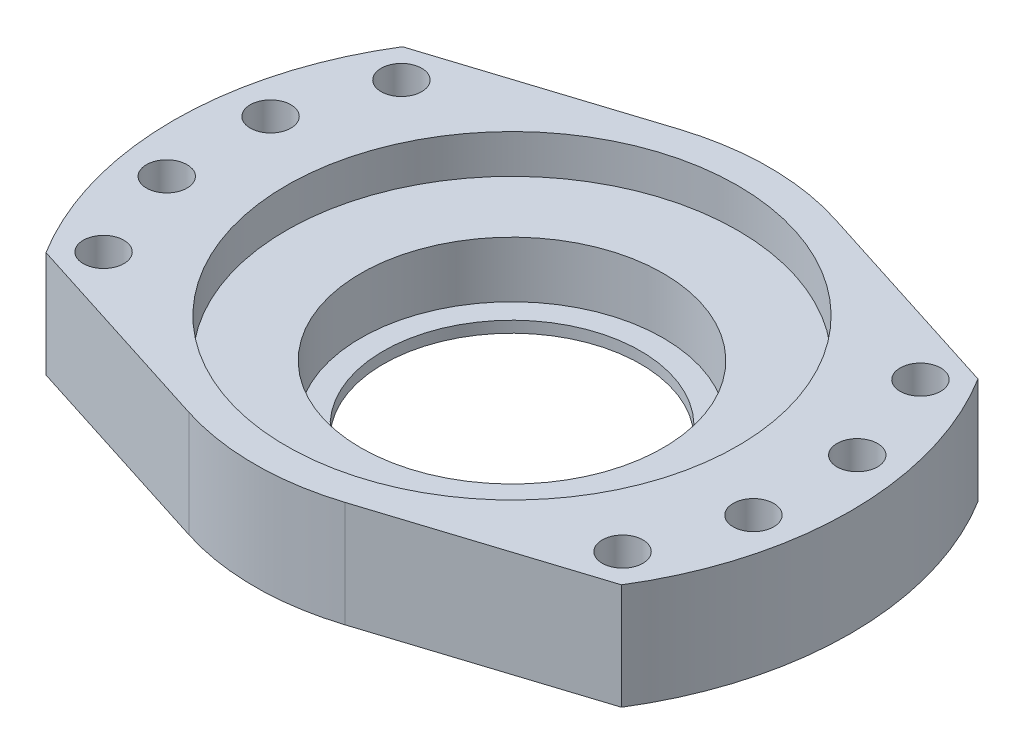
ISO-10303-21;
HEADER;
FILE_DESCRIPTION(('STEP AP214'),'2;1');
FILE_NAME('part.step','',(''),(''),'','','');
FILE_SCHEMA(('AUTOMOTIVE_DESIGN { 1 0 10303 214 1 1 1 1 }'));
ENDSEC;
DATA;
#1=APPLICATION_CONTEXT('core data for automotive mechanical design processes');
#2=APPLICATION_PROTOCOL_DEFINITION('international standard','automotive_design',2000,#1);
#3=PRODUCT_CONTEXT('',#1,'mechanical');
#4=PRODUCT('Part','Part','',(#3));
#5=PRODUCT_RELATED_PRODUCT_CATEGORY('part','',(#4));
#6=PRODUCT_DEFINITION_FORMATION('','',#4);
#7=PRODUCT_DEFINITION_CONTEXT('part definition',#1,'design');
#8=PRODUCT_DEFINITION('design','',#6,#7);
#9=PRODUCT_DEFINITION_SHAPE('','',#8);
#10=(LENGTH_UNIT() NAMED_UNIT(*) SI_UNIT(.MILLI.,.METRE.));
#11=(NAMED_UNIT(*) PLANE_ANGLE_UNIT() SI_UNIT($,.RADIAN.));
#12=(NAMED_UNIT(*) SI_UNIT($,.STERADIAN.) SOLID_ANGLE_UNIT());
#13=UNCERTAINTY_MEASURE_WITH_UNIT(LENGTH_MEASURE(1.E-05),#10,'distance_accuracy_value','');
#14=(GEOMETRIC_REPRESENTATION_CONTEXT(3) GLOBAL_UNCERTAINTY_ASSIGNED_CONTEXT((#13)) GLOBAL_UNIT_ASSIGNED_CONTEXT((#10,
#11,#12)) REPRESENTATION_CONTEXT('',''));
#15=CARTESIAN_POINT('',(0.,0.,0.));
#16=DIRECTION('',(0.,0.,1.));
#17=DIRECTION('',(1.,0.,0.));
#18=AXIS2_PLACEMENT_3D('',#15,#16,#17);
#19=CARTESIAN_POINT('',(0.,4.80000000000003,0.));
#20=DIRECTION('',(0.,-1.,0.));
#21=DIRECTION('',(0.,0.,-1.));
#22=AXIS2_PLACEMENT_3D('',#19,#20,#21);
#23=PLANE('',#22);
#24=CARTESIAN_POINT('',(0.,4.80000000000003,0.));
#25=DIRECTION('',(0.,-1.,0.));
#26=DIRECTION('',(0.,0.,-1.));
#27=AXIS2_PLACEMENT_3D('',#24,#25,#26);
#28=CIRCLE('',#27,67.);
#29=CARTESIAN_POINT('',(0.,4.80000000000003,-67.0000000000003));
#30=VERTEX_POINT('',#29);
#31=EDGE_CURVE('E194',#30,#30,#28,.T.);
#32=ORIENTED_EDGE('',*,*,#31,.T.);
#33=EDGE_LOOP('',(#32));
#34=FACE_BOUND('',#33,.T.);
#35=CARTESIAN_POINT('',(0.,4.80000000000003,0.));
#36=DIRECTION('',(0.,-1.,0.));
#37=DIRECTION('',(0.,0.,-1.));
#38=AXIS2_PLACEMENT_3D('',#35,#36,#37);
#39=CIRCLE('',#38,100.);
#40=CARTESIAN_POINT('',(0.,4.80000000000003,-100.));
#41=VERTEX_POINT('',#40);
#42=EDGE_CURVE('E19',#41,#41,#39,.F.);
#43=ORIENTED_EDGE('',*,*,#42,.T.);
#44=EDGE_LOOP('',(#43));
#45=FACE_BOUND('',#44,.T.);
#46=ADVANCED_FACE('F16',(#34,#45),#23,.F.);
#47=CARTESIAN_POINT('',(0.,22.,0.));
#48=DIRECTION('',(0.,-1.,0.));
#49=DIRECTION('',(0.,0.,-1.));
#50=AXIS2_PLACEMENT_3D('',#47,#48,#49);
#51=CYLINDRICAL_SURFACE('',#50,100.);
#52=CARTESIAN_POINT('',(0.,22.,0.));
#53=DIRECTION('',(0.,-1.,0.));
#54=DIRECTION('',(0.,0.,-1.));
#55=AXIS2_PLACEMENT_3D('',#52,#53,#54);
#56=CIRCLE('',#55,100.);
#57=CARTESIAN_POINT('',(0.,22.,-100.));
#58=VERTEX_POINT('',#57);
#59=EDGE_CURVE('E192',#58,#58,#56,.T.);
#60=ORIENTED_EDGE('',*,*,#59,.F.);
#61=EDGE_LOOP('',(#60));
#62=FACE_BOUND('',#61,.T.);
#63=ORIENTED_EDGE('',*,*,#42,.F.);
#64=EDGE_LOOP('',(#63));
#65=FACE_BOUND('',#64,.T.);
#66=ADVANCED_FACE('F202',(#62,#65),#51,.F.);
#67=CARTESIAN_POINT('',(0.,4.80000000000003,0.));
#68=DIRECTION('',(0.,-1.,0.));
#69=DIRECTION('',(0.,0.,-1.));
#70=AXIS2_PLACEMENT_3D('',#67,#68,#69);
#71=CYLINDRICAL_SURFACE('',#70,67.);
#72=CARTESIAN_POINT('',(0.,-20.0000000000005,0.));
#73=DIRECTION('',(0.,-1.,0.));
#74=DIRECTION('',(0.,0.,-1.));
#75=AXIS2_PLACEMENT_3D('',#72,#73,#74);
#76=CIRCLE('',#75,67.);
#77=CARTESIAN_POINT('',(0.,-20.0000000000005,-67.0000000000003));
#78=VERTEX_POINT('',#77);
#79=EDGE_CURVE('E90',#78,#78,#76,.T.);
#80=ORIENTED_EDGE('',*,*,#79,.T.);
#81=EDGE_LOOP('',(#80));
#82=FACE_BOUND('',#81,.T.);
#83=ORIENTED_EDGE('',*,*,#31,.F.);
#84=EDGE_LOOP('',(#83));
#85=FACE_BOUND('',#84,.T.);
#86=ADVANCED_FACE('F204',(#82,#85),#71,.F.);
#87=CARTESIAN_POINT('',(0.,22.,0.));
#88=DIRECTION('',(0.,1.,0.));
#89=DIRECTION('',(0.,0.,1.));
#90=AXIS2_PLACEMENT_3D('',#87,#88,#89);
#91=PLANE('',#90);
#92=CARTESIAN_POINT('',(-115.,22.,-66.));
#93=DIRECTION('',(0.,1.,0.));
#94=DIRECTION('',(0.,0.,1.));
#95=AXIS2_PLACEMENT_3D('',#92,#93,#94);
#96=CIRCLE('',#95,9.);
#97=CARTESIAN_POINT('',(-115.,22.,-56.9999999999999));
#98=VERTEX_POINT('',#97);
#99=EDGE_CURVE('E159',#98,#98,#96,.F.);
#100=ORIENTED_EDGE('',*,*,#99,.T.);
#101=EDGE_LOOP('',(#100));
#102=FACE_BOUND('',#101,.T.);
#103=CARTESIAN_POINT('',(-130.000000000001,22.,-22.9999999999999));
#104=DIRECTION('',(0.,1.,0.));
#105=DIRECTION('',(0.,0.,1.));
#106=AXIS2_PLACEMENT_3D('',#103,#104,#105);
#107=CIRCLE('',#106,9.);
#108=CARTESIAN_POINT('',(-130.000000000001,22.,-13.9999999999998));
#109=VERTEX_POINT('',#108);
#110=EDGE_CURVE('E162',#109,#109,#107,.F.);
#111=ORIENTED_EDGE('',*,*,#110,.T.);
#112=EDGE_LOOP('',(#111));
#113=FACE_BOUND('',#112,.T.);
#114=CARTESIAN_POINT('',(115.,22.,-66.0000000000001));
#115=DIRECTION('',(0.,1.,0.));
#116=DIRECTION('',(0.,0.,1.));
#117=AXIS2_PLACEMENT_3D('',#114,#115,#116);
#118=CIRCLE('',#117,9.);
#119=CARTESIAN_POINT('',(115.,22.,-57.));
#120=VERTEX_POINT('',#119);
#121=EDGE_CURVE('E165',#120,#120,#118,.F.);
#122=ORIENTED_EDGE('',*,*,#121,.T.);
#123=EDGE_LOOP('',(#122));
#124=FACE_BOUND('',#123,.T.);
#125=CARTESIAN_POINT('',(130.,22.,-23.));
#126=DIRECTION('',(0.,1.,0.));
#127=DIRECTION('',(0.,0.,1.));
#128=AXIS2_PLACEMENT_3D('',#125,#126,#127);
#129=CIRCLE('',#128,9.);
#130=CARTESIAN_POINT('',(130.,22.,-14.));
#131=VERTEX_POINT('',#130);
#132=EDGE_CURVE('E168',#131,#131,#129,.F.);
#133=ORIENTED_EDGE('',*,*,#132,.T.);
#134=EDGE_LOOP('',(#133));
#135=FACE_BOUND('',#134,.T.);
#136=CARTESIAN_POINT('',(-115.,21.999999999999,66.0000000000011));
#137=DIRECTION('',(0.,1.,0.));
#138=DIRECTION('',(0.,0.,1.));
#139=AXIS2_PLACEMENT_3D('',#136,#137,#138);
#140=CIRCLE('',#139,9.);
#141=CARTESIAN_POINT('',(-115.,21.999999999999,75.0000000000011));
#142=VERTEX_POINT('',#141);
#143=EDGE_CURVE('E171',#142,#142,#140,.F.);
#144=ORIENTED_EDGE('',*,*,#143,.T.);
#145=EDGE_LOOP('',(#144));
#146=FACE_BOUND('',#145,.T.);
#147=CARTESIAN_POINT('',(-130.000000000001,22.,23.0000000000006));
#148=DIRECTION('',(0.,1.,0.));
#149=DIRECTION('',(0.,0.,1.));
#150=AXIS2_PLACEMENT_3D('',#147,#148,#149);
#151=CIRCLE('',#150,9.);
#152=CARTESIAN_POINT('',(-130.000000000001,22.,32.0000000000007));
#153=VERTEX_POINT('',#152);
#154=EDGE_CURVE('E174',#153,#153,#151,.F.);
#155=ORIENTED_EDGE('',*,*,#154,.T.);
#156=EDGE_LOOP('',(#155));
#157=FACE_BOUND('',#156,.T.);
#158=CARTESIAN_POINT('',(115.,21.999999999999,66.0000000000006));
#159=DIRECTION('',(0.,1.,0.));
#160=DIRECTION('',(0.,0.,1.));
#161=AXIS2_PLACEMENT_3D('',#158,#159,#160);
#162=CIRCLE('',#161,9.);
#163=CARTESIAN_POINT('',(115.,21.999999999999,75.0000000000007));
#164=VERTEX_POINT('',#163);
#165=EDGE_CURVE('E177',#164,#164,#162,.F.);
#166=ORIENTED_EDGE('',*,*,#165,.T.);
#167=EDGE_LOOP('',(#166));
#168=FACE_BOUND('',#167,.T.);
#169=CARTESIAN_POINT('',(130.,22.,23.0000000000005));
#170=DIRECTION('',(0.,1.,0.));
#171=DIRECTION('',(0.,0.,1.));
#172=AXIS2_PLACEMENT_3D('',#169,#170,#171);
#173=CIRCLE('',#172,9.);
#174=CARTESIAN_POINT('',(130.,22.,32.0000000000005));
#175=VERTEX_POINT('',#174);
#176=EDGE_CURVE('E107',#175,#175,#173,.F.);
#177=ORIENTED_EDGE('',*,*,#176,.T.);
#178=EDGE_LOOP('',(#177));
#179=FACE_BOUND('',#178,.T.);
#180=ORIENTED_EDGE('',*,*,#59,.T.);
#181=EDGE_LOOP('',(#180));
#182=FACE_BOUND('',#181,.T.);
#183=DIRECTION('',(-0.952748002701294,0.,0.303761820097094));
#184=VECTOR('',#183,1.);
#185=CARTESIAN_POINT('',(-34.6288474910001,22.,-108.613272308));
#186=LINE('',#185,#184);
#187=CARTESIAN_POINT('',(-127.510783857822,22.,-78.9999999999668));
#188=VERTEX_POINT('',#187);
#189=CARTESIAN_POINT('',(-34.6288474910389,22.,-108.613272307988));
#190=VERTEX_POINT('',#189);
#191=EDGE_CURVE('E84',#188,#190,#186,.F.);
#192=ORIENTED_EDGE('',*,*,#191,.F.);
#193=CARTESIAN_POINT('',(0.,22.,0.));
#194=DIRECTION('',(0.,1.,0.));
#195=DIRECTION('',(0.,0.,1.));
#196=AXIS2_PLACEMENT_3D('',#193,#194,#195);
#197=CIRCLE('',#196,150.);
#198=CARTESIAN_POINT('',(-127.510783857801,21.999999999999,79.0000000000653));
#199=VERTEX_POINT('',#198);
#200=EDGE_CURVE('E79',#199,#188,#197,.F.);
#201=ORIENTED_EDGE('',*,*,#200,.F.);
#202=DIRECTION('',(0.952748002701296,0.,0.303761820097094));
#203=VECTOR('',#202,1.);
#204=CARTESIAN_POINT('',(-127.510783858,21.999999999999,79.000000000002));
#205=LINE('',#204,#203);
#206=CARTESIAN_POINT('',(-34.6288474910475,21.999999999999,108.613272308016));
#207=VERTEX_POINT('',#206);
#208=EDGE_CURVE('E82',#207,#199,#205,.F.);
#209=ORIENTED_EDGE('',*,*,#208,.F.);
#210=CARTESIAN_POINT('',(0.,22.,0.));
#211=DIRECTION('',(0.,1.,0.));
#212=DIRECTION('',(0.,0.,1.));
#213=AXIS2_PLACEMENT_3D('',#210,#211,#212);
#214=CIRCLE('',#213,114.);
#215=CARTESIAN_POINT('',(34.628847491039,21.999999999999,108.613272307989));
#216=VERTEX_POINT('',#215);
#217=EDGE_CURVE('E188',#216,#207,#214,.F.);
#218=ORIENTED_EDGE('',*,*,#217,.F.);
#219=DIRECTION('',(0.952748002701294,0.,-0.303761820097094));
#220=VECTOR('',#219,1.);
#221=CARTESIAN_POINT('',(34.6288474910001,21.999999999999,108.613272308002));
#222=LINE('',#221,#220);
#223=CARTESIAN_POINT('',(127.51078385772,21.999999999999,78.9999999999373));
#224=VERTEX_POINT('',#223);
#225=EDGE_CURVE('E114',#224,#216,#222,.F.);
#226=ORIENTED_EDGE('',*,*,#225,.F.);
#227=CARTESIAN_POINT('',(0.,22.,0.));
#228=DIRECTION('',(0.,1.,0.));
#229=DIRECTION('',(0.,0.,1.));
#230=AXIS2_PLACEMENT_3D('',#227,#228,#229);
#231=CIRCLE('',#230,150.);
#232=CARTESIAN_POINT('',(127.510783857801,22.,-79.0000000000638));
#233=VERTEX_POINT('',#232);
#234=EDGE_CURVE('E185',#233,#224,#231,.F.);
#235=ORIENTED_EDGE('',*,*,#234,.F.);
#236=DIRECTION('',(-0.952748002701296,0.,-0.303761820097094));
#237=VECTOR('',#236,1.);
#238=CARTESIAN_POINT('',(127.510783858,22.,-79.0000000000001));
#239=LINE('',#238,#237);
#240=CARTESIAN_POINT('',(34.6288474910473,22.,-108.613272308015));
#241=VERTEX_POINT('',#240);
#242=EDGE_CURVE('E109',#241,#233,#239,.F.);
#243=ORIENTED_EDGE('',*,*,#242,.F.);
#244=CARTESIAN_POINT('',(0.,22.,0.));
#245=DIRECTION('',(0.,1.,0.));
#246=DIRECTION('',(0.,0.,1.));
#247=AXIS2_PLACEMENT_3D('',#244,#245,#246);
#248=CIRCLE('',#247,114.);
#249=EDGE_CURVE('E182',#190,#241,#248,.F.);
#250=ORIENTED_EDGE('',*,*,#249,.F.);
#251=EDGE_LOOP('',(#192,#201,#209,#218,#226,#235,#243,#250));
#252=FACE_BOUND('',#251,.T.);
#253=ADVANCED_FACE('F81',(#102,#113,#124,#135,#146,#157,#168,#179,#182,#252),#91,.T.);
#254=CARTESIAN_POINT('',(0.,-20.0000000000005,0.));
#255=DIRECTION('',(0.,-1.,0.));
#256=DIRECTION('',(0.,0.,-1.));
#257=AXIS2_PLACEMENT_3D('',#254,#255,#256);
#258=PLANE('',#257);
#259=CARTESIAN_POINT('',(0.,-20.0000000000005,0.));
#260=DIRECTION('',(0.,1.,0.));
#261=DIRECTION('',(0.,0.,1.));
#262=AXIS2_PLACEMENT_3D('',#259,#260,#261);
#263=CIRCLE('',#262,57.);
#264=CARTESIAN_POINT('',(0.,-20.0000000000005,57.0000000000002));
#265=VERTEX_POINT('',#264);
#266=EDGE_CURVE('E156',#265,#265,#263,.F.);
#267=ORIENTED_EDGE('',*,*,#266,.T.);
#268=EDGE_LOOP('',(#267));
#269=FACE_BOUND('',#268,.T.);
#270=ORIENTED_EDGE('',*,*,#79,.F.);
#271=EDGE_LOOP('',(#270));
#272=FACE_BOUND('',#271,.T.);
#273=ADVANCED_FACE('F286',(#269,#272),#258,.F.);
#274=CARTESIAN_POINT('',(0.,-25.0000000000005,0.));
#275=DIRECTION('',(0.,1.,0.));
#276=DIRECTION('',(0.,0.,1.));
#277=AXIS2_PLACEMENT_3D('',#274,#275,#276);
#278=CYLINDRICAL_SURFACE('',#277,150.);
#279=DIRECTION('',(0.,1.,0.));
#280=VECTOR('',#279,1.);
#281=CARTESIAN_POINT('',(-127.510783858,-25.0000000000005,79.000000000002));
#282=LINE('',#281,#280);
#283=CARTESIAN_POINT('',(-127.510783857801,-25.0000000000005,79.0000000000653));
#284=VERTEX_POINT('',#283);
#285=EDGE_CURVE('E89',#199,#284,#282,.F.);
#286=ORIENTED_EDGE('',*,*,#285,.F.);
#287=ORIENTED_EDGE('',*,*,#200,.T.);
#288=DIRECTION('',(0.,1.,0.));
#289=VECTOR('',#288,1.);
#290=CARTESIAN_POINT('',(-127.510783857974,-25.0000000000006,-78.9999999999185));
#291=LINE('',#290,#289);
#292=CARTESIAN_POINT('',(-127.510783857788,-25.0000000000006,-79.0000000000229));
#293=VERTEX_POINT('',#292);
#294=EDGE_CURVE('E108',#293,#188,#291,.T.);
#295=ORIENTED_EDGE('',*,*,#294,.F.);
#296=CARTESIAN_POINT('',(0.,-25.0000000000005,0.));
#297=DIRECTION('',(0.,1.,0.));
#298=DIRECTION('',(0.,0.,1.));
#299=AXIS2_PLACEMENT_3D('',#296,#297,#298);
#300=CIRCLE('',#299,150.);
#301=EDGE_CURVE('E101',#293,#284,#300,.T.);
#302=ORIENTED_EDGE('',*,*,#301,.T.);
#303=EDGE_LOOP('',(#286,#287,#295,#302));
#304=FACE_BOUND('',#303,.T.);
#305=ADVANCED_FACE('F100',(#304),#278,.T.);
#306=CARTESIAN_POINT('',(-127.510783858,-25.0000000000005,79.000000000002));
#307=DIRECTION('',(-0.303761820097094,0.,0.952748002701296));
#308=DIRECTION('',(0.952748002701296,0.,0.303761820097094));
#309=AXIS2_PLACEMENT_3D('',#306,#307,#308);
#310=PLANE('',#309);
#311=DIRECTION('',(0.,1.,0.));
#312=VECTOR('',#311,1.);
#313=CARTESIAN_POINT('',(-34.6288474909913,-25.,108.613272307974));
#314=LINE('',#313,#312);
#315=CARTESIAN_POINT('',(-34.6288474909867,-25.,108.61327230799));
#316=VERTEX_POINT('',#315);
#317=EDGE_CURVE('E97',#207,#316,#314,.F.);
#318=ORIENTED_EDGE('',*,*,#317,.F.);
#319=ORIENTED_EDGE('',*,*,#208,.T.);
#320=ORIENTED_EDGE('',*,*,#285,.T.);
#321=DIRECTION('',(0.952748002701564,0.,0.303761820096256));
#322=VECTOR('',#321,1.);
#323=CARTESIAN_POINT('',(-127.510783858,-25.0000000000005,79.000000000002));
#324=LINE('',#323,#322);
#325=EDGE_CURVE('E154',#284,#316,#324,.T.);
#326=ORIENTED_EDGE('',*,*,#325,.T.);
#327=EDGE_LOOP('',(#318,#319,#320,#326));
#328=FACE_BOUND('',#327,.T.);
#329=ADVANCED_FACE('F94',(#328),#310,.T.);
#330=CARTESIAN_POINT('',(0.,-25.0000000000005,0.));
#331=DIRECTION('',(0.,1.,0.));
#332=DIRECTION('',(0.,0.,1.));
#333=AXIS2_PLACEMENT_3D('',#330,#331,#332);
#334=CYLINDRICAL_SURFACE('',#333,114.);
#335=DIRECTION('',(0.,1.,0.));
#336=VECTOR('',#335,1.);
#337=CARTESIAN_POINT('',(34.6288474909999,-25.,108.613272308002));
#338=LINE('',#337,#336);
#339=CARTESIAN_POINT('',(34.6288474909902,-25.,108.613272308004));
#340=VERTEX_POINT('',#339);
#341=EDGE_CURVE('E117',#216,#340,#338,.F.);
#342=ORIENTED_EDGE('',*,*,#341,.F.);
#343=ORIENTED_EDGE('',*,*,#217,.T.);
#344=ORIENTED_EDGE('',*,*,#317,.T.);
#345=CARTESIAN_POINT('',(0.,-25.0000000000005,0.));
#346=DIRECTION('',(0.,1.,0.));
#347=DIRECTION('',(0.,0.,1.));
#348=AXIS2_PLACEMENT_3D('',#345,#346,#347);
#349=CIRCLE('',#348,114.);
#350=EDGE_CURVE('E151',#316,#340,#349,.T.);
#351=ORIENTED_EDGE('',*,*,#350,.T.);
#352=EDGE_LOOP('',(#342,#343,#344,#351));
#353=FACE_BOUND('',#352,.T.);
#354=ADVANCED_FACE('F277',(#353),#334,.T.);
#355=CARTESIAN_POINT('',(34.6288474909999,-25.,108.613272308002));
#356=DIRECTION('',(0.303761820097094,0.,0.952748002701294));
#357=DIRECTION('',(0.952748002701294,0.,-0.303761820097094));
#358=AXIS2_PLACEMENT_3D('',#355,#356,#357);
#359=PLANE('',#358);
#360=DIRECTION('',(0.,1.,0.));
#361=VECTOR('',#360,1.);
#362=CARTESIAN_POINT('',(127.510783857769,-25.0000000000005,78.9999999998583));
#363=LINE('',#362,#361);
#364=CARTESIAN_POINT('',(127.510783857685,-25.0000000000005,78.9999999999932));
#365=VERTEX_POINT('',#364);
#366=EDGE_CURVE('E116',#224,#365,#363,.F.);
#367=ORIENTED_EDGE('',*,*,#366,.F.);
#368=ORIENTED_EDGE('',*,*,#225,.T.);
#369=ORIENTED_EDGE('',*,*,#341,.T.);
#370=DIRECTION('',(0.952748002701561,0.,-0.303761820096256));
#371=VECTOR('',#370,1.);
#372=CARTESIAN_POINT('',(34.6288474909999,-25.,108.613272308002));
#373=LINE('',#372,#371);
#374=EDGE_CURVE('E150',#340,#365,#373,.T.);
#375=ORIENTED_EDGE('',*,*,#374,.T.);
#376=EDGE_LOOP('',(#367,#368,#369,#375));
#377=FACE_BOUND('',#376,.T.);
#378=ADVANCED_FACE('F273',(#377),#359,.T.);
#379=CARTESIAN_POINT('',(0.,-25.0000000000005,0.));
#380=DIRECTION('',(0.,1.,0.));
#381=DIRECTION('',(0.,0.,1.));
#382=AXIS2_PLACEMENT_3D('',#379,#380,#381);
#383=CYLINDRICAL_SURFACE('',#382,150.);
#384=DIRECTION('',(0.,1.,0.));
#385=VECTOR('',#384,1.);
#386=CARTESIAN_POINT('',(127.510783858,-25.0000000000006,-79.0000000000004));
#387=LINE('',#386,#385);
#388=CARTESIAN_POINT('',(127.510783857801,-25.0000000000006,-79.0000000000637));
#389=VERTEX_POINT('',#388);
#390=EDGE_CURVE('E113',#233,#389,#387,.F.);
#391=ORIENTED_EDGE('',*,*,#390,.F.);
#392=ORIENTED_EDGE('',*,*,#234,.T.);
#393=ORIENTED_EDGE('',*,*,#366,.T.);
#394=CARTESIAN_POINT('',(0.,-25.0000000000005,0.));
#395=DIRECTION('',(0.,1.,0.));
#396=DIRECTION('',(0.,0.,1.));
#397=AXIS2_PLACEMENT_3D('',#394,#395,#396);
#398=CIRCLE('',#397,150.);
#399=EDGE_CURVE('E147',#365,#389,#398,.T.);
#400=ORIENTED_EDGE('',*,*,#399,.T.);
#401=EDGE_LOOP('',(#391,#392,#393,#400));
#402=FACE_BOUND('',#401,.T.);
#403=ADVANCED_FACE('F269',(#402),#383,.T.);
#404=CARTESIAN_POINT('',(127.510783858,-25.0000000000006,-79.0000000000004));
#405=DIRECTION('',(0.303761820097094,0.,-0.952748002701296));
#406=DIRECTION('',(-0.952748002701296,0.,-0.303761820097094));
#407=AXIS2_PLACEMENT_3D('',#404,#405,#406);
#408=PLANE('',#407);
#409=DIRECTION('',(0.,1.,0.));
#410=VECTOR('',#409,1.);
#411=CARTESIAN_POINT('',(34.628847490991,-25.,-108.613272307972));
#412=LINE('',#411,#410);
#413=CARTESIAN_POINT('',(34.6288474909865,-25.,-108.613272307989));
#414=VERTEX_POINT('',#413);
#415=EDGE_CURVE('E112',#241,#414,#412,.F.);
#416=ORIENTED_EDGE('',*,*,#415,.F.);
#417=ORIENTED_EDGE('',*,*,#242,.T.);
#418=ORIENTED_EDGE('',*,*,#390,.T.);
#419=DIRECTION('',(-0.952748002701564,0.,-0.303761820096256));
#420=VECTOR('',#419,1.);
#421=CARTESIAN_POINT('',(127.510783858,-25.0000000000006,-79.0000000000004));
#422=LINE('',#421,#420);
#423=EDGE_CURVE('E146',#389,#414,#422,.T.);
#424=ORIENTED_EDGE('',*,*,#423,.T.);
#425=EDGE_LOOP('',(#416,#417,#418,#424));
#426=FACE_BOUND('',#425,.T.);
#427=ADVANCED_FACE('F265',(#426),#408,.T.);
#428=CARTESIAN_POINT('',(0.,-25.0000000000005,0.));
#429=DIRECTION('',(0.,1.,0.));
#430=DIRECTION('',(0.,0.,1.));
#431=AXIS2_PLACEMENT_3D('',#428,#429,#430);
#432=CYLINDRICAL_SURFACE('',#431,114.);
#433=DIRECTION('',(0.,1.,0.));
#434=VECTOR('',#433,1.);
#435=CARTESIAN_POINT('',(-34.6288474910001,-25.,-108.613272308));
#436=LINE('',#435,#434);
#437=CARTESIAN_POINT('',(-34.6288474909911,-25.,-108.613272308003));
#438=VERTEX_POINT('',#437);
#439=EDGE_CURVE('E34',#190,#438,#436,.F.);
#440=ORIENTED_EDGE('',*,*,#439,.F.);
#441=ORIENTED_EDGE('',*,*,#249,.T.);
#442=ORIENTED_EDGE('',*,*,#415,.T.);
#443=CARTESIAN_POINT('',(0.,-25.0000000000005,0.));
#444=DIRECTION('',(0.,1.,0.));
#445=DIRECTION('',(0.,0.,1.));
#446=AXIS2_PLACEMENT_3D('',#443,#444,#445);
#447=CIRCLE('',#446,114.);
#448=EDGE_CURVE('E143',#414,#438,#447,.T.);
#449=ORIENTED_EDGE('',*,*,#448,.T.);
#450=EDGE_LOOP('',(#440,#441,#442,#449));
#451=FACE_BOUND('',#450,.T.);
#452=ADVANCED_FACE('F262',(#451),#432,.T.);
#453=CARTESIAN_POINT('',(-34.6288474910001,-25.,-108.613272308));
#454=DIRECTION('',(-0.303761820097094,0.,-0.952748002701294));
#455=DIRECTION('',(-0.952748002701294,0.,0.303761820097094));
#456=AXIS2_PLACEMENT_3D('',#453,#454,#455);
#457=PLANE('',#456);
#458=ORIENTED_EDGE('',*,*,#294,.T.);
#459=ORIENTED_EDGE('',*,*,#191,.T.);
#460=ORIENTED_EDGE('',*,*,#439,.T.);
#461=DIRECTION('',(-0.952748002701561,0.,0.303761820096256));
#462=VECTOR('',#461,1.);
#463=CARTESIAN_POINT('',(-34.6288474910001,-25.,-108.613272308));
#464=LINE('',#463,#462);
#465=EDGE_CURVE('E142',#438,#293,#464,.T.);
#466=ORIENTED_EDGE('',*,*,#465,.T.);
#467=EDGE_LOOP('',(#458,#459,#460,#466));
#468=FACE_BOUND('',#467,.T.);
#469=ADVANCED_FACE('F258',(#468),#457,.T.);
#470=CARTESIAN_POINT('',(130.,22.,23.0000000000005));
#471=DIRECTION('',(0.,1.,0.));
#472=DIRECTION('',(0.,0.,1.));
#473=AXIS2_PLACEMENT_3D('',#470,#471,#472);
#474=CYLINDRICAL_SURFACE('',#473,9.);
#475=ORIENTED_EDGE('',*,*,#176,.F.);
#476=EDGE_LOOP('',(#475));
#477=FACE_BOUND('',#476,.T.);
#478=CARTESIAN_POINT('',(130.,-25.0000000000005,23.0000000000005));
#479=DIRECTION('',(0.,1.,0.));
#480=DIRECTION('',(0.,0.,1.));
#481=AXIS2_PLACEMENT_3D('',#478,#479,#480);
#482=CIRCLE('',#481,9.);
#483=CARTESIAN_POINT('',(130.,-25.0000000000005,32.0000000000005));
#484=VERTEX_POINT('',#483);
#485=EDGE_CURVE('E139',#484,#484,#482,.F.);
#486=ORIENTED_EDGE('',*,*,#485,.T.);
#487=EDGE_LOOP('',(#486));
#488=FACE_BOUND('',#487,.T.);
#489=ADVANCED_FACE('F254',(#477,#488),#474,.F.);
#490=CARTESIAN_POINT('',(115.,21.999999999999,66.0000000000006));
#491=DIRECTION('',(0.,1.,0.));
#492=DIRECTION('',(0.,0.,1.));
#493=AXIS2_PLACEMENT_3D('',#490,#491,#492);
#494=CYLINDRICAL_SURFACE('',#493,9.);
#495=ORIENTED_EDGE('',*,*,#165,.F.);
#496=EDGE_LOOP('',(#495));
#497=FACE_BOUND('',#496,.T.);
#498=CARTESIAN_POINT('',(115.,-25.0000000000005,66.0000000000011));
#499=DIRECTION('',(0.,1.,0.));
#500=DIRECTION('',(0.,0.,1.));
#501=AXIS2_PLACEMENT_3D('',#498,#499,#500);
#502=CIRCLE('',#501,9.);
#503=CARTESIAN_POINT('',(115.,-25.0000000000005,75.0000000000011));
#504=VERTEX_POINT('',#503);
#505=EDGE_CURVE('E136',#504,#504,#502,.F.);
#506=ORIENTED_EDGE('',*,*,#505,.T.);
#507=EDGE_LOOP('',(#506));
#508=FACE_BOUND('',#507,.T.);
#509=ADVANCED_FACE('F250',(#497,#508),#494,.F.);
#510=CARTESIAN_POINT('',(-130.000000000001,22.,23.0000000000006));
#511=DIRECTION('',(0.,1.,0.));
#512=DIRECTION('',(0.,0.,1.));
#513=AXIS2_PLACEMENT_3D('',#510,#511,#512);
#514=CYLINDRICAL_SURFACE('',#513,9.);
#515=ORIENTED_EDGE('',*,*,#154,.F.);
#516=EDGE_LOOP('',(#515));
#517=FACE_BOUND('',#516,.T.);
#518=CARTESIAN_POINT('',(-130.000000000001,-25.0000000000005,23.0000000000006));
#519=DIRECTION('',(0.,1.,0.));
#520=DIRECTION('',(0.,0.,1.));
#521=AXIS2_PLACEMENT_3D('',#518,#519,#520);
#522=CIRCLE('',#521,9.);
#523=CARTESIAN_POINT('',(-130.000000000001,-25.0000000000005,32.0000000000007));
#524=VERTEX_POINT('',#523);
#525=EDGE_CURVE('E133',#524,#524,#522,.F.);
#526=ORIENTED_EDGE('',*,*,#525,.T.);
#527=EDGE_LOOP('',(#526));
#528=FACE_BOUND('',#527,.T.);
#529=ADVANCED_FACE('F246',(#517,#528),#514,.F.);
#530=CARTESIAN_POINT('',(-115.,21.999999999999,66.0000000000011));
#531=DIRECTION('',(0.,1.,0.));
#532=DIRECTION('',(0.,0.,1.));
#533=AXIS2_PLACEMENT_3D('',#530,#531,#532);
#534=CYLINDRICAL_SURFACE('',#533,9.);
#535=ORIENTED_EDGE('',*,*,#143,.F.);
#536=EDGE_LOOP('',(#535));
#537=FACE_BOUND('',#536,.T.);
#538=CARTESIAN_POINT('',(-115.,-25.0000000000005,66.0000000000014));
#539=DIRECTION('',(0.,1.,0.));
#540=DIRECTION('',(0.,0.,1.));
#541=AXIS2_PLACEMENT_3D('',#538,#539,#540);
#542=CIRCLE('',#541,9.);
#543=CARTESIAN_POINT('',(-115.,-25.0000000000005,75.0000000000015));
#544=VERTEX_POINT('',#543);
#545=EDGE_CURVE('E130',#544,#544,#542,.F.);
#546=ORIENTED_EDGE('',*,*,#545,.T.);
#547=EDGE_LOOP('',(#546));
#548=FACE_BOUND('',#547,.T.);
#549=ADVANCED_FACE('F242',(#537,#548),#534,.F.);
#550=CARTESIAN_POINT('',(130.,22.,-23.));
#551=DIRECTION('',(0.,1.,0.));
#552=DIRECTION('',(0.,0.,1.));
#553=AXIS2_PLACEMENT_3D('',#550,#551,#552);
#554=CYLINDRICAL_SURFACE('',#553,9.);
#555=ORIENTED_EDGE('',*,*,#132,.F.);
#556=EDGE_LOOP('',(#555));
#557=FACE_BOUND('',#556,.T.);
#558=CARTESIAN_POINT('',(130.,-25.0000000000005,-23.));
#559=DIRECTION('',(0.,1.,0.));
#560=DIRECTION('',(0.,0.,1.));
#561=AXIS2_PLACEMENT_3D('',#558,#559,#560);
#562=CIRCLE('',#561,9.);
#563=CARTESIAN_POINT('',(130.,-25.0000000000005,-14.));
#564=VERTEX_POINT('',#563);
#565=EDGE_CURVE('E127',#564,#564,#562,.F.);
#566=ORIENTED_EDGE('',*,*,#565,.T.);
#567=EDGE_LOOP('',(#566));
#568=FACE_BOUND('',#567,.T.);
#569=ADVANCED_FACE('F238',(#557,#568),#554,.F.);
#570=CARTESIAN_POINT('',(115.,22.,-66.0000000000001));
#571=DIRECTION('',(0.,1.,0.));
#572=DIRECTION('',(0.,0.,1.));
#573=AXIS2_PLACEMENT_3D('',#570,#571,#572);
#574=CYLINDRICAL_SURFACE('',#573,9.);
#575=ORIENTED_EDGE('',*,*,#121,.F.);
#576=EDGE_LOOP('',(#575));
#577=FACE_BOUND('',#576,.T.);
#578=CARTESIAN_POINT('',(115.,-25.0000000000006,-66.));
#579=DIRECTION('',(0.,1.,0.));
#580=DIRECTION('',(0.,0.,1.));
#581=AXIS2_PLACEMENT_3D('',#578,#579,#580);
#582=CIRCLE('',#581,9.);
#583=CARTESIAN_POINT('',(115.,-25.0000000000006,-57.));
#584=VERTEX_POINT('',#583);
#585=EDGE_CURVE('E124',#584,#584,#582,.F.);
#586=ORIENTED_EDGE('',*,*,#585,.T.);
#587=EDGE_LOOP('',(#586));
#588=FACE_BOUND('',#587,.T.);
#589=ADVANCED_FACE('F234',(#577,#588),#574,.F.);
#590=CARTESIAN_POINT('',(-130.000000000001,22.,-22.9999999999999));
#591=DIRECTION('',(0.,1.,0.));
#592=DIRECTION('',(0.,0.,1.));
#593=AXIS2_PLACEMENT_3D('',#590,#591,#592);
#594=CYLINDRICAL_SURFACE('',#593,9.);
#595=ORIENTED_EDGE('',*,*,#110,.F.);
#596=EDGE_LOOP('',(#595));
#597=FACE_BOUND('',#596,.T.);
#598=CARTESIAN_POINT('',(-130.000000000001,-25.0000000000005,-22.9999999999999));
#599=DIRECTION('',(0.,1.,0.));
#600=DIRECTION('',(0.,0.,1.));
#601=AXIS2_PLACEMENT_3D('',#598,#599,#600);
#602=CIRCLE('',#601,9.);
#603=CARTESIAN_POINT('',(-130.000000000001,-25.0000000000005,-13.9999999999998));
#604=VERTEX_POINT('',#603);
#605=EDGE_CURVE('E121',#604,#604,#602,.F.);
#606=ORIENTED_EDGE('',*,*,#605,.T.);
#607=EDGE_LOOP('',(#606));
#608=FACE_BOUND('',#607,.T.);
#609=ADVANCED_FACE('F230',(#597,#608),#594,.F.);
#610=CARTESIAN_POINT('',(-115.,22.,-66.));
#611=DIRECTION('',(0.,1.,0.));
#612=DIRECTION('',(0.,0.,1.));
#613=AXIS2_PLACEMENT_3D('',#610,#611,#612);
#614=CYLINDRICAL_SURFACE('',#613,9.);
#615=ORIENTED_EDGE('',*,*,#99,.F.);
#616=EDGE_LOOP('',(#615));
#617=FACE_BOUND('',#616,.T.);
#618=CARTESIAN_POINT('',(-115.,-25.0000000000006,-65.9999999999995));
#619=DIRECTION('',(0.,1.,0.));
#620=DIRECTION('',(0.,0.,1.));
#621=AXIS2_PLACEMENT_3D('',#618,#619,#620);
#622=CIRCLE('',#621,9.);
#623=CARTESIAN_POINT('',(-115.,-25.0000000000006,-56.9999999999994));
#624=VERTEX_POINT('',#623);
#625=EDGE_CURVE('E25',#624,#624,#622,.F.);
#626=ORIENTED_EDGE('',*,*,#625,.T.);
#627=EDGE_LOOP('',(#626));
#628=FACE_BOUND('',#627,.T.);
#629=ADVANCED_FACE('F222',(#617,#628),#614,.F.);
#630=CARTESIAN_POINT('',(0.,-89.7732050808005,0.));
#631=DIRECTION('',(0.,1.,0.));
#632=DIRECTION('',(0.,0.,1.));
#633=AXIS2_PLACEMENT_3D('',#630,#631,#632);
#634=CYLINDRICAL_SURFACE('',#633,57.);
#635=ORIENTED_EDGE('',*,*,#266,.F.);
#636=EDGE_LOOP('',(#635));
#637=FACE_BOUND('',#636,.T.);
#638=CARTESIAN_POINT('',(0.,-25.0000000000005,0.));
#639=DIRECTION('',(0.,1.,0.));
#640=DIRECTION('',(0.,0.,1.));
#641=AXIS2_PLACEMENT_3D('',#638,#639,#640);
#642=CIRCLE('',#641,57.);
#643=CARTESIAN_POINT('',(0.,-25.0000000000005,57.0000000000002));
#644=VERTEX_POINT('',#643);
#645=EDGE_CURVE('E11',#644,#644,#642,.F.);
#646=ORIENTED_EDGE('',*,*,#645,.T.);
#647=EDGE_LOOP('',(#646));
#648=FACE_BOUND('',#647,.T.);
#649=ADVANCED_FACE('F216',(#637,#648),#634,.F.);
#650=CARTESIAN_POINT('',(0.,-25.0000000000005,0.));
#651=DIRECTION('',(0.,1.,0.));
#652=DIRECTION('',(0.,0.,1.));
#653=AXIS2_PLACEMENT_3D('',#650,#651,#652);
#654=PLANE('',#653);
#655=ORIENTED_EDGE('',*,*,#645,.F.);
#656=EDGE_LOOP('',(#655));
#657=FACE_BOUND('',#656,.T.);
#658=ORIENTED_EDGE('',*,*,#625,.F.);
#659=EDGE_LOOP('',(#658));
#660=FACE_BOUND('',#659,.T.);
#661=ORIENTED_EDGE('',*,*,#605,.F.);
#662=EDGE_LOOP('',(#661));
#663=FACE_BOUND('',#662,.T.);
#664=ORIENTED_EDGE('',*,*,#585,.F.);
#665=EDGE_LOOP('',(#664));
#666=FACE_BOUND('',#665,.T.);
#667=ORIENTED_EDGE('',*,*,#565,.F.);
#668=EDGE_LOOP('',(#667));
#669=FACE_BOUND('',#668,.T.);
#670=ORIENTED_EDGE('',*,*,#545,.F.);
#671=EDGE_LOOP('',(#670));
#672=FACE_BOUND('',#671,.T.);
#673=ORIENTED_EDGE('',*,*,#525,.F.);
#674=EDGE_LOOP('',(#673));
#675=FACE_BOUND('',#674,.T.);
#676=ORIENTED_EDGE('',*,*,#505,.F.);
#677=EDGE_LOOP('',(#676));
#678=FACE_BOUND('',#677,.T.);
#679=ORIENTED_EDGE('',*,*,#485,.F.);
#680=EDGE_LOOP('',(#679));
#681=FACE_BOUND('',#680,.T.);
#682=ORIENTED_EDGE('',*,*,#448,.F.);
#683=ORIENTED_EDGE('',*,*,#423,.F.);
#684=ORIENTED_EDGE('',*,*,#399,.F.);
#685=ORIENTED_EDGE('',*,*,#374,.F.);
#686=ORIENTED_EDGE('',*,*,#350,.F.);
#687=ORIENTED_EDGE('',*,*,#325,.F.);
#688=ORIENTED_EDGE('',*,*,#301,.F.);
#689=ORIENTED_EDGE('',*,*,#465,.F.);
#690=EDGE_LOOP('',(#682,#683,#684,#685,#686,#687,#688,#689));
#691=FACE_BOUND('',#690,.T.);
#692=ADVANCED_FACE('F214',(#657,#660,#663,#666,#669,#672,#675,#678,#681,#691),#654,.F.);
#693=CLOSED_SHELL('',(#46,#66,#86,#253,#273,#305,#329,#354,#378,#403,#427,#452,#469,#489,#509,
#529,#549,#569,#589,#609,#629,#649,#692));
#694=MANIFOLD_SOLID_BREP('B1',#693);
#695=ADVANCED_BREP_SHAPE_REPRESENTATION('',(#18,#694),#14);
#696=SHAPE_DEFINITION_REPRESENTATION(#9,#695);
ENDSEC;
END-ISO-10303-21;
